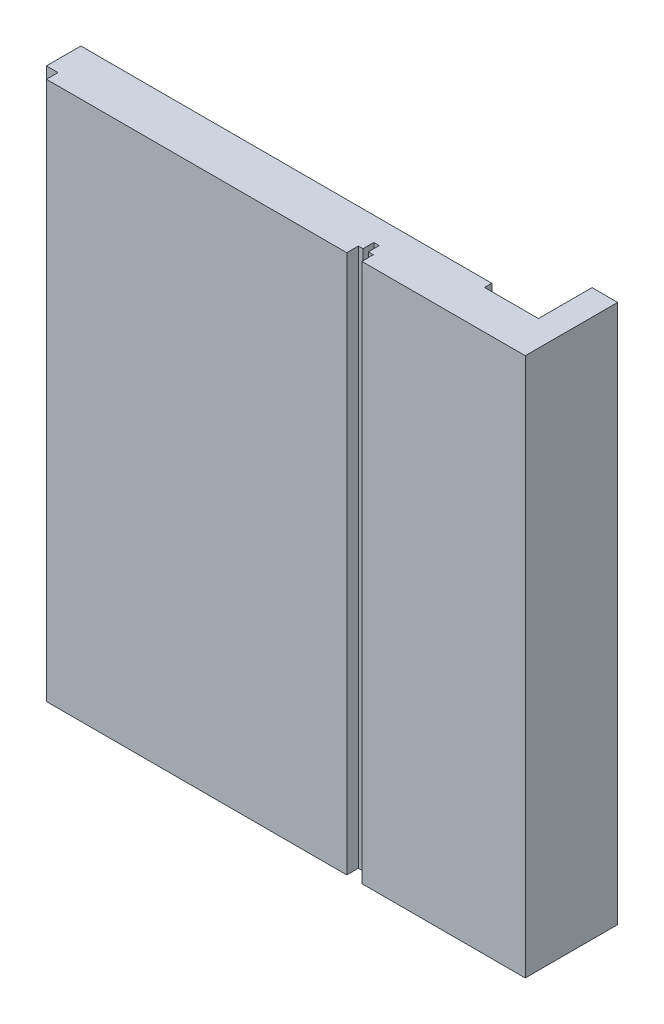
ISO-10303-21;
HEADER;
FILE_DESCRIPTION(('STEP AP214'),'2;1');
FILE_NAME('part.step','',(''),(''),'','','');
FILE_SCHEMA(('AUTOMOTIVE_DESIGN { 1 0 10303 214 1 1 1 1 }'));
ENDSEC;
DATA;
#1=APPLICATION_CONTEXT('core data for automotive mechanical design processes');
#2=APPLICATION_PROTOCOL_DEFINITION('international standard','automotive_design',2000,#1);
#3=PRODUCT_CONTEXT('',#1,'mechanical');
#4=PRODUCT('Part','Part','',(#3));
#5=PRODUCT_RELATED_PRODUCT_CATEGORY('part','',(#4));
#6=PRODUCT_DEFINITION_FORMATION('','',#4);
#7=PRODUCT_DEFINITION_CONTEXT('part definition',#1,'design');
#8=PRODUCT_DEFINITION('design','',#6,#7);
#9=PRODUCT_DEFINITION_SHAPE('','',#8);
#10=(LENGTH_UNIT() NAMED_UNIT(*) SI_UNIT(.MILLI.,.METRE.));
#11=(NAMED_UNIT(*) PLANE_ANGLE_UNIT() SI_UNIT($,.RADIAN.));
#12=(NAMED_UNIT(*) SI_UNIT($,.STERADIAN.) SOLID_ANGLE_UNIT());
#13=UNCERTAINTY_MEASURE_WITH_UNIT(LENGTH_MEASURE(1.E-05),#10,'distance_accuracy_value','');
#14=(GEOMETRIC_REPRESENTATION_CONTEXT(3) GLOBAL_UNCERTAINTY_ASSIGNED_CONTEXT((#13)) GLOBAL_UNIT_ASSIGNED_CONTEXT((#10,
#11,#12)) REPRESENTATION_CONTEXT('',''));
#15=CARTESIAN_POINT('',(0.,0.,0.));
#16=DIRECTION('',(0.,0.,1.));
#17=DIRECTION('',(1.,0.,0.));
#18=AXIS2_PLACEMENT_3D('',#15,#16,#17);
#19=CARTESIAN_POINT('',(0.,100.,0.));
#20=DIRECTION('',(-1.,0.,0.));
#21=DIRECTION('',(0.,0.,1.));
#22=AXIS2_PLACEMENT_3D('',#19,#20,#21);
#23=PLANE('',#22);
#24=DIRECTION('',(0.,0.,-1.));
#25=VECTOR('',#24,1.);
#26=CARTESIAN_POINT('',(0.,0.,0.));
#27=LINE('',#26,#25);
#28=CARTESIAN_POINT('',(0.,0.,2.14));
#29=VERTEX_POINT('',#28);
#30=CARTESIAN_POINT('',(0.,0.,-15.));
#31=VERTEX_POINT('',#30);
#32=EDGE_CURVE('E115',#29,#31,#27,.T.);
#33=ORIENTED_EDGE('',*,*,#32,.T.);
#34=DIRECTION('',(0.,-1.,0.));
#35=VECTOR('',#34,1.);
#36=CARTESIAN_POINT('',(0.,100.,-15.));
#37=LINE('',#36,#35);
#38=CARTESIAN_POINT('',(0.,100.,-15.));
#39=VERTEX_POINT('',#38);
#40=EDGE_CURVE('E11',#39,#31,#37,.T.);
#41=ORIENTED_EDGE('',*,*,#40,.F.);
#42=DIRECTION('',(0.,0.,-1.));
#43=VECTOR('',#42,1.);
#44=CARTESIAN_POINT('',(0.,100.,2.14));
#45=LINE('',#44,#43);
#46=CARTESIAN_POINT('',(0.,100.,2.14));
#47=VERTEX_POINT('',#46);
#48=EDGE_CURVE('E121',#47,#39,#45,.T.);
#49=ORIENTED_EDGE('',*,*,#48,.F.);
#50=DIRECTION('',(0.,-1.,0.));
#51=VECTOR('',#50,1.);
#52=CARTESIAN_POINT('',(0.,100.,2.14));
#53=LINE('',#52,#51);
#54=EDGE_CURVE('E185',#47,#29,#53,.T.);
#55=ORIENTED_EDGE('',*,*,#54,.T.);
#56=EDGE_LOOP('',(#33,#41,#49,#55));
#57=FACE_BOUND('',#56,.T.);
#58=ADVANCED_FACE('F33',(#57),#23,.F.);
#59=CARTESIAN_POINT('',(0.,100.,-15.));
#60=DIRECTION('',(0.,0.,1.));
#61=DIRECTION('',(1.,0.,0.));
#62=AXIS2_PLACEMENT_3D('',#59,#60,#61);
#63=PLANE('',#62);
#64=DIRECTION('',(-1.,0.,0.));
#65=VECTOR('',#64,1.);
#66=CARTESIAN_POINT('',(0.,0.,-15.));
#67=LINE('',#66,#65);
#68=CARTESIAN_POINT('',(-4.75,0.,-15.));
#69=VERTEX_POINT('',#68);
#70=EDGE_CURVE('E190',#31,#69,#67,.T.);
#71=ORIENTED_EDGE('',*,*,#70,.T.);
#72=DIRECTION('',(0.,-1.,0.));
#73=VECTOR('',#72,1.);
#74=CARTESIAN_POINT('',(-4.75,100.,-15.));
#75=LINE('',#74,#73);
#76=CARTESIAN_POINT('',(-4.75,100.,-15.));
#77=VERTEX_POINT('',#76);
#78=EDGE_CURVE('E41',#77,#69,#75,.T.);
#79=ORIENTED_EDGE('',*,*,#78,.F.);
#80=DIRECTION('',(-1.,0.,0.));
#81=VECTOR('',#80,1.);
#82=CARTESIAN_POINT('',(0.,100.,-15.));
#83=LINE('',#82,#81);
#84=EDGE_CURVE('E320',#39,#77,#83,.T.);
#85=ORIENTED_EDGE('',*,*,#84,.F.);
#86=ORIENTED_EDGE('',*,*,#40,.T.);
#87=EDGE_LOOP('',(#71,#79,#85,#86));
#88=FACE_BOUND('',#87,.T.);
#89=ADVANCED_FACE('F323',(#88),#63,.F.);
#90=CARTESIAN_POINT('',(-4.75,100.,-15.));
#91=DIRECTION('',(1.,0.,0.));
#92=DIRECTION('',(0.,0.,-1.));
#93=AXIS2_PLACEMENT_3D('',#90,#91,#92);
#94=PLANE('',#93);
#95=DIRECTION('',(0.,0.,1.));
#96=VECTOR('',#95,1.);
#97=CARTESIAN_POINT('',(-4.75,0.,-15.));
#98=LINE('',#97,#96);
#99=CARTESIAN_POINT('',(-4.75,0.,-5.05));
#100=VERTEX_POINT('',#99);
#101=EDGE_CURVE('E192',#69,#100,#98,.T.);
#102=ORIENTED_EDGE('',*,*,#101,.T.);
#103=DIRECTION('',(0.,-1.,0.));
#104=VECTOR('',#103,1.);
#105=CARTESIAN_POINT('',(-4.75,100.,-5.05));
#106=LINE('',#105,#104);
#107=CARTESIAN_POINT('',(-4.75,100.,-5.05));
#108=VERTEX_POINT('',#107);
#109=EDGE_CURVE('E259',#108,#100,#106,.T.);
#110=ORIENTED_EDGE('',*,*,#109,.F.);
#111=DIRECTION('',(0.,0.,1.));
#112=VECTOR('',#111,1.);
#113=CARTESIAN_POINT('',(-4.75,100.,-15.));
#114=LINE('',#113,#112);
#115=EDGE_CURVE('E268',#77,#108,#114,.T.);
#116=ORIENTED_EDGE('',*,*,#115,.F.);
#117=ORIENTED_EDGE('',*,*,#78,.T.);
#118=EDGE_LOOP('',(#102,#110,#116,#117));
#119=FACE_BOUND('',#118,.T.);
#120=ADVANCED_FACE('F266',(#119),#94,.F.);
#121=CARTESIAN_POINT('',(-4.75,100.,-5.05));
#122=DIRECTION('',(0.,0.,1.));
#123=DIRECTION('',(1.,0.,0.));
#124=AXIS2_PLACEMENT_3D('',#121,#122,#123);
#125=PLANE('',#124);
#126=DIRECTION('',(-1.,0.,0.));
#127=VECTOR('',#126,1.);
#128=CARTESIAN_POINT('',(-4.75,0.,-5.05));
#129=LINE('',#128,#127);
#130=CARTESIAN_POINT('',(-14.75,0.,-5.05));
#131=VERTEX_POINT('',#130);
#132=EDGE_CURVE('E194',#100,#131,#129,.T.);
#133=ORIENTED_EDGE('',*,*,#132,.T.);
#134=DIRECTION('',(0.,-1.,0.));
#135=VECTOR('',#134,1.);
#136=CARTESIAN_POINT('',(-14.75,100.,-5.05));
#137=LINE('',#136,#135);
#138=CARTESIAN_POINT('',(-14.75,100.,-5.05));
#139=VERTEX_POINT('',#138);
#140=EDGE_CURVE('E256',#139,#131,#137,.T.);
#141=ORIENTED_EDGE('',*,*,#140,.F.);
#142=DIRECTION('',(-1.,0.,0.));
#143=VECTOR('',#142,1.);
#144=CARTESIAN_POINT('',(-4.75,100.,-5.05));
#145=LINE('',#144,#143);
#146=EDGE_CURVE('E286',#108,#139,#145,.T.);
#147=ORIENTED_EDGE('',*,*,#146,.F.);
#148=ORIENTED_EDGE('',*,*,#109,.T.);
#149=EDGE_LOOP('',(#133,#141,#147,#148));
#150=FACE_BOUND('',#149,.T.);
#151=ADVANCED_FACE('F277',(#150),#125,.F.);
#152=CARTESIAN_POINT('',(-14.75,100.,-5.05));
#153=DIRECTION('',(-1.,0.,0.));
#154=DIRECTION('',(0.,0.,1.));
#155=AXIS2_PLACEMENT_3D('',#152,#153,#154);
#156=PLANE('',#155);
#157=DIRECTION('',(0.,0.,-1.));
#158=VECTOR('',#157,1.);
#159=CARTESIAN_POINT('',(-14.75,0.,-5.05));
#160=LINE('',#159,#158);
#161=CARTESIAN_POINT('',(-14.75,0.,-6.4));
#162=VERTEX_POINT('',#161);
#163=EDGE_CURVE('E196',#131,#162,#160,.T.);
#164=ORIENTED_EDGE('',*,*,#163,.T.);
#165=DIRECTION('',(0.,-1.,0.));
#166=VECTOR('',#165,1.);
#167=CARTESIAN_POINT('',(-14.75,100.,-6.4));
#168=LINE('',#167,#166);
#169=CARTESIAN_POINT('',(-14.75,100.,-6.4));
#170=VERTEX_POINT('',#169);
#171=EDGE_CURVE('E253',#170,#162,#168,.T.);
#172=ORIENTED_EDGE('',*,*,#171,.F.);
#173=DIRECTION('',(0.,0.,-1.));
#174=VECTOR('',#173,1.);
#175=CARTESIAN_POINT('',(-14.75,100.,-5.05));
#176=LINE('',#175,#174);
#177=EDGE_CURVE('E283',#139,#170,#176,.T.);
#178=ORIENTED_EDGE('',*,*,#177,.F.);
#179=ORIENTED_EDGE('',*,*,#140,.T.);
#180=EDGE_LOOP('',(#164,#172,#178,#179));
#181=FACE_BOUND('',#180,.T.);
#182=ADVANCED_FACE('F281',(#181),#156,.F.);
#183=CARTESIAN_POINT('',(-14.75,100.,-6.4));
#184=DIRECTION('',(0.,0.,1.));
#185=DIRECTION('',(1.,0.,0.));
#186=AXIS2_PLACEMENT_3D('',#183,#184,#185);
#187=PLANE('',#186);
#188=DIRECTION('',(-1.,0.,0.));
#189=VECTOR('',#188,1.);
#190=CARTESIAN_POINT('',(-14.75,0.,-6.4));
#191=LINE('',#190,#189);
#192=CARTESIAN_POINT('',(-91.,0.,-6.39999999999999));
#193=VERTEX_POINT('',#192);
#194=EDGE_CURVE('E198',#162,#193,#191,.T.);
#195=ORIENTED_EDGE('',*,*,#194,.T.);
#196=DIRECTION('',(0.,-1.,0.));
#197=VECTOR('',#196,1.);
#198=CARTESIAN_POINT('',(-91.,100.,-6.39999999999999));
#199=LINE('',#198,#197);
#200=CARTESIAN_POINT('',(-91.,100.,-6.39999999999999));
#201=VERTEX_POINT('',#200);
#202=EDGE_CURVE('E250',#201,#193,#199,.T.);
#203=ORIENTED_EDGE('',*,*,#202,.F.);
#204=DIRECTION('',(-1.,0.,0.));
#205=VECTOR('',#204,1.);
#206=CARTESIAN_POINT('',(-14.75,100.,-6.4));
#207=LINE('',#206,#205);
#208=EDGE_CURVE('E285',#170,#201,#207,.T.);
#209=ORIENTED_EDGE('',*,*,#208,.F.);
#210=ORIENTED_EDGE('',*,*,#171,.T.);
#211=EDGE_LOOP('',(#195,#203,#209,#210));
#212=FACE_BOUND('',#211,.T.);
#213=ADVANCED_FACE('F335',(#212),#187,.F.);
#214=CARTESIAN_POINT('',(-91.,100.,0.));
#215=DIRECTION('',(1.,0.,0.));
#216=DIRECTION('',(0.,0.,-1.));
#217=AXIS2_PLACEMENT_3D('',#214,#215,#216);
#218=PLANE('',#217);
#219=DIRECTION('',(0.,0.,1.));
#220=VECTOR('',#219,1.);
#221=CARTESIAN_POINT('',(-91.,0.,0.));
#222=LINE('',#221,#220);
#223=CARTESIAN_POINT('',(-91.,0.,0.));
#224=VERTEX_POINT('',#223);
#225=EDGE_CURVE('E200',#193,#224,#222,.T.);
#226=ORIENTED_EDGE('',*,*,#225,.T.);
#227=DIRECTION('',(0.,-1.,0.));
#228=VECTOR('',#227,1.);
#229=CARTESIAN_POINT('',(-91.,100.,0.));
#230=LINE('',#229,#228);
#231=CARTESIAN_POINT('',(-91.,100.,0.));
#232=VERTEX_POINT('',#231);
#233=EDGE_CURVE('E247',#232,#224,#230,.T.);
#234=ORIENTED_EDGE('',*,*,#233,.F.);
#235=DIRECTION('',(0.,0.,1.));
#236=VECTOR('',#235,1.);
#237=CARTESIAN_POINT('',(-91.,100.,0.));
#238=LINE('',#237,#236);
#239=EDGE_CURVE('E288',#201,#232,#238,.T.);
#240=ORIENTED_EDGE('',*,*,#239,.F.);
#241=ORIENTED_EDGE('',*,*,#202,.T.);
#242=EDGE_LOOP('',(#226,#234,#240,#241));
#243=FACE_BOUND('',#242,.T.);
#244=ADVANCED_FACE('F338',(#243),#218,.F.);
#245=CARTESIAN_POINT('',(-91.,100.,0.));
#246=DIRECTION('',(0.,0.,-1.));
#247=DIRECTION('',(-1.,0.,0.));
#248=AXIS2_PLACEMENT_3D('',#245,#246,#247);
#249=PLANE('',#248);
#250=DIRECTION('',(1.,0.,0.));
#251=VECTOR('',#250,1.);
#252=CARTESIAN_POINT('',(-91.,0.,0.));
#253=LINE('',#252,#251);
#254=CARTESIAN_POINT('',(-88.85,0.,0.));
#255=VERTEX_POINT('',#254);
#256=EDGE_CURVE('E202',#224,#255,#253,.T.);
#257=ORIENTED_EDGE('',*,*,#256,.T.);
#258=DIRECTION('',(0.,-1.,0.));
#259=VECTOR('',#258,1.);
#260=CARTESIAN_POINT('',(-88.85,100.,0.));
#261=LINE('',#260,#259);
#262=CARTESIAN_POINT('',(-88.85,100.,0.));
#263=VERTEX_POINT('',#262);
#264=EDGE_CURVE('E244',#263,#255,#261,.T.);
#265=ORIENTED_EDGE('',*,*,#264,.F.);
#266=DIRECTION('',(1.,0.,0.));
#267=VECTOR('',#266,1.);
#268=CARTESIAN_POINT('',(-91.,100.,0.));
#269=LINE('',#268,#267);
#270=EDGE_CURVE('E294',#232,#263,#269,.T.);
#271=ORIENTED_EDGE('',*,*,#270,.F.);
#272=ORIENTED_EDGE('',*,*,#233,.T.);
#273=EDGE_LOOP('',(#257,#265,#271,#272));
#274=FACE_BOUND('',#273,.T.);
#275=ADVANCED_FACE('F342',(#274),#249,.F.);
#276=CARTESIAN_POINT('',(-88.85,100.,0.));
#277=DIRECTION('',(1.,0.,0.));
#278=DIRECTION('',(0.,0.,-1.));
#279=AXIS2_PLACEMENT_3D('',#276,#277,#278);
#280=PLANE('',#279);
#281=DIRECTION('',(0.,0.,1.));
#282=VECTOR('',#281,1.);
#283=CARTESIAN_POINT('',(-88.85,0.,0.));
#284=LINE('',#283,#282);
#285=CARTESIAN_POINT('',(-88.85,0.,2.14));
#286=VERTEX_POINT('',#285);
#287=EDGE_CURVE('E204',#255,#286,#284,.T.);
#288=ORIENTED_EDGE('',*,*,#287,.T.);
#289=DIRECTION('',(0.,-1.,0.));
#290=VECTOR('',#289,1.);
#291=CARTESIAN_POINT('',(-88.85,100.,2.14));
#292=LINE('',#291,#290);
#293=CARTESIAN_POINT('',(-88.85,100.,2.14));
#294=VERTEX_POINT('',#293);
#295=EDGE_CURVE('E241',#294,#286,#292,.T.);
#296=ORIENTED_EDGE('',*,*,#295,.F.);
#297=DIRECTION('',(0.,0.,1.));
#298=VECTOR('',#297,1.);
#299=CARTESIAN_POINT('',(-88.85,100.,0.));
#300=LINE('',#299,#298);
#301=EDGE_CURVE('E296',#263,#294,#300,.T.);
#302=ORIENTED_EDGE('',*,*,#301,.F.);
#303=ORIENTED_EDGE('',*,*,#264,.T.);
#304=EDGE_LOOP('',(#288,#296,#302,#303));
#305=FACE_BOUND('',#304,.T.);
#306=ADVANCED_FACE('F346',(#305),#280,.F.);
#307=CARTESIAN_POINT('',(-88.85,100.,2.14));
#308=DIRECTION('',(0.,0.,-1.));
#309=DIRECTION('',(-1.,0.,0.));
#310=AXIS2_PLACEMENT_3D('',#307,#308,#309);
#311=PLANE('',#310);
#312=DIRECTION('',(1.,0.,0.));
#313=VECTOR('',#312,1.);
#314=CARTESIAN_POINT('',(-88.85,0.,2.14));
#315=LINE('',#314,#313);
#316=CARTESIAN_POINT('',(-33.12,0.,2.14));
#317=VERTEX_POINT('',#316);
#318=EDGE_CURVE('E206',#286,#317,#315,.T.);
#319=ORIENTED_EDGE('',*,*,#318,.T.);
#320=DIRECTION('',(0.,-1.,0.));
#321=VECTOR('',#320,1.);
#322=CARTESIAN_POINT('',(-33.12,100.,2.14));
#323=LINE('',#322,#321);
#324=CARTESIAN_POINT('',(-33.12,100.,2.14));
#325=VERTEX_POINT('',#324);
#326=EDGE_CURVE('E238',#325,#317,#323,.T.);
#327=ORIENTED_EDGE('',*,*,#326,.F.);
#328=DIRECTION('',(1.,0.,0.));
#329=VECTOR('',#328,1.);
#330=CARTESIAN_POINT('',(-88.85,100.,2.14));
#331=LINE('',#330,#329);
#332=EDGE_CURVE('E298',#294,#325,#331,.T.);
#333=ORIENTED_EDGE('',*,*,#332,.F.);
#334=ORIENTED_EDGE('',*,*,#295,.T.);
#335=EDGE_LOOP('',(#319,#327,#333,#334));
#336=FACE_BOUND('',#335,.T.);
#337=ADVANCED_FACE('F350',(#336),#311,.F.);
#338=CARTESIAN_POINT('',(-33.12,100.,2.14));
#339=DIRECTION('',(-1.,0.,0.));
#340=DIRECTION('',(0.,0.,1.));
#341=AXIS2_PLACEMENT_3D('',#338,#339,#340);
#342=PLANE('',#341);
#343=DIRECTION('',(0.,0.,-1.));
#344=VECTOR('',#343,1.);
#345=CARTESIAN_POINT('',(-33.12,0.,2.14));
#346=LINE('',#345,#344);
#347=CARTESIAN_POINT('',(-33.12,0.,0.));
#348=VERTEX_POINT('',#347);
#349=EDGE_CURVE('E208',#317,#348,#346,.T.);
#350=ORIENTED_EDGE('',*,*,#349,.T.);
#351=DIRECTION('',(0.,-1.,0.));
#352=VECTOR('',#351,1.);
#353=CARTESIAN_POINT('',(-33.12,100.,0.));
#354=LINE('',#353,#352);
#355=CARTESIAN_POINT('',(-33.12,100.,0.));
#356=VERTEX_POINT('',#355);
#357=EDGE_CURVE('E235',#356,#348,#354,.T.);
#358=ORIENTED_EDGE('',*,*,#357,.F.);
#359=DIRECTION('',(0.,0.,-1.));
#360=VECTOR('',#359,1.);
#361=CARTESIAN_POINT('',(-33.12,100.,2.14));
#362=LINE('',#361,#360);
#363=EDGE_CURVE('E300',#325,#356,#362,.T.);
#364=ORIENTED_EDGE('',*,*,#363,.F.);
#365=ORIENTED_EDGE('',*,*,#326,.T.);
#366=EDGE_LOOP('',(#350,#358,#364,#365));
#367=FACE_BOUND('',#366,.T.);
#368=ADVANCED_FACE('F354',(#367),#342,.F.);
#369=CARTESIAN_POINT('',(-32.25,100.,0.));
#370=DIRECTION('',(0.,0.,-1.));
#371=DIRECTION('',(-1.,0.,0.));
#372=AXIS2_PLACEMENT_3D('',#369,#370,#371);
#373=PLANE('',#372);
#374=DIRECTION('',(1.,0.,0.));
#375=VECTOR('',#374,1.);
#376=CARTESIAN_POINT('',(-32.25,0.,0.));
#377=LINE('',#376,#375);
#378=CARTESIAN_POINT('',(-32.25,0.,0.));
#379=VERTEX_POINT('',#378);
#380=EDGE_CURVE('E210',#348,#379,#377,.T.);
#381=ORIENTED_EDGE('',*,*,#380,.T.);
#382=DIRECTION('',(0.,-1.,0.));
#383=VECTOR('',#382,1.);
#384=CARTESIAN_POINT('',(-32.25,100.,0.));
#385=LINE('',#384,#383);
#386=CARTESIAN_POINT('',(-32.25,100.,0.));
#387=VERTEX_POINT('',#386);
#388=EDGE_CURVE('E232',#387,#379,#385,.T.);
#389=ORIENTED_EDGE('',*,*,#388,.F.);
#390=DIRECTION('',(1.,0.,0.));
#391=VECTOR('',#390,1.);
#392=CARTESIAN_POINT('',(-32.25,100.,0.));
#393=LINE('',#392,#391);
#394=EDGE_CURVE('E302',#356,#387,#393,.T.);
#395=ORIENTED_EDGE('',*,*,#394,.F.);
#396=ORIENTED_EDGE('',*,*,#357,.T.);
#397=EDGE_LOOP('',(#381,#389,#395,#396));
#398=FACE_BOUND('',#397,.T.);
#399=ADVANCED_FACE('F358',(#398),#373,.F.);
#400=CARTESIAN_POINT('',(-32.25,100.,0.));
#401=DIRECTION('',(-1.,0.,0.));
#402=DIRECTION('',(0.,0.,1.));
#403=AXIS2_PLACEMENT_3D('',#400,#401,#402);
#404=PLANE('',#403);
#405=DIRECTION('',(0.,0.,-1.));
#406=VECTOR('',#405,1.);
#407=CARTESIAN_POINT('',(-32.25,0.,0.));
#408=LINE('',#407,#406);
#409=CARTESIAN_POINT('',(-32.25,0.,-2.00000000000001));
#410=VERTEX_POINT('',#409);
#411=EDGE_CURVE('E212',#379,#410,#408,.T.);
#412=ORIENTED_EDGE('',*,*,#411,.T.);
#413=DIRECTION('',(0.,-1.,0.));
#414=VECTOR('',#413,1.);
#415=CARTESIAN_POINT('',(-32.25,100.,-2.00000000000001));
#416=LINE('',#415,#414);
#417=CARTESIAN_POINT('',(-32.25,100.,-2.00000000000001));
#418=VERTEX_POINT('',#417);
#419=EDGE_CURVE('E229',#418,#410,#416,.T.);
#420=ORIENTED_EDGE('',*,*,#419,.F.);
#421=DIRECTION('',(0.,0.,-1.));
#422=VECTOR('',#421,1.);
#423=CARTESIAN_POINT('',(-32.25,100.,0.));
#424=LINE('',#423,#422);
#425=EDGE_CURVE('E304',#387,#418,#424,.T.);
#426=ORIENTED_EDGE('',*,*,#425,.F.);
#427=ORIENTED_EDGE('',*,*,#388,.T.);
#428=EDGE_LOOP('',(#412,#420,#426,#427));
#429=FACE_BOUND('',#428,.T.);
#430=ADVANCED_FACE('F362',(#429),#404,.F.);
#431=CARTESIAN_POINT('',(-32.25,100.,-2.00000000000001));
#432=DIRECTION('',(0.,0.,-1.));
#433=DIRECTION('',(-1.,0.,0.));
#434=AXIS2_PLACEMENT_3D('',#431,#432,#433);
#435=PLANE('',#434);
#436=DIRECTION('',(1.,0.,0.));
#437=VECTOR('',#436,1.);
#438=CARTESIAN_POINT('',(-32.25,0.,-2.00000000000001));
#439=LINE('',#438,#437);
#440=CARTESIAN_POINT('',(-31.25,0.,-2.00000000000001));
#441=VERTEX_POINT('',#440);
#442=EDGE_CURVE('E214',#410,#441,#439,.T.);
#443=ORIENTED_EDGE('',*,*,#442,.T.);
#444=DIRECTION('',(0.,-1.,0.));
#445=VECTOR('',#444,1.);
#446=CARTESIAN_POINT('',(-31.25,100.,-2.00000000000001));
#447=LINE('',#446,#445);
#448=CARTESIAN_POINT('',(-31.25,100.,-2.00000000000001));
#449=VERTEX_POINT('',#448);
#450=EDGE_CURVE('E226',#449,#441,#447,.T.);
#451=ORIENTED_EDGE('',*,*,#450,.F.);
#452=DIRECTION('',(1.,0.,0.));
#453=VECTOR('',#452,1.);
#454=CARTESIAN_POINT('',(-32.25,100.,-2.00000000000001));
#455=LINE('',#454,#453);
#456=EDGE_CURVE('E306',#418,#449,#455,.T.);
#457=ORIENTED_EDGE('',*,*,#456,.F.);
#458=ORIENTED_EDGE('',*,*,#419,.T.);
#459=EDGE_LOOP('',(#443,#451,#457,#458));
#460=FACE_BOUND('',#459,.T.);
#461=ADVANCED_FACE('F312',(#460),#435,.F.);
#462=CARTESIAN_POINT('',(-31.25,100.,-2.00000000000001));
#463=DIRECTION('',(1.,0.,0.));
#464=DIRECTION('',(0.,0.,-1.));
#465=AXIS2_PLACEMENT_3D('',#462,#463,#464);
#466=PLANE('',#465);
#467=DIRECTION('',(0.,0.,1.));
#468=VECTOR('',#467,1.);
#469=CARTESIAN_POINT('',(-31.25,0.,-2.00000000000001));
#470=LINE('',#469,#468);
#471=CARTESIAN_POINT('',(-31.25,0.,0.));
#472=VERTEX_POINT('',#471);
#473=EDGE_CURVE('E216',#441,#472,#470,.T.);
#474=ORIENTED_EDGE('',*,*,#473,.T.);
#475=DIRECTION('',(0.,-1.,0.));
#476=VECTOR('',#475,1.);
#477=CARTESIAN_POINT('',(-31.25,100.,0.));
#478=LINE('',#477,#476);
#479=CARTESIAN_POINT('',(-31.25,100.,0.));
#480=VERTEX_POINT('',#479);
#481=EDGE_CURVE('E180',#480,#472,#478,.T.);
#482=ORIENTED_EDGE('',*,*,#481,.F.);
#483=DIRECTION('',(0.,0.,1.));
#484=VECTOR('',#483,1.);
#485=CARTESIAN_POINT('',(-31.25,100.,-2.00000000000001));
#486=LINE('',#485,#484);
#487=EDGE_CURVE('E171',#449,#480,#486,.T.);
#488=ORIENTED_EDGE('',*,*,#487,.F.);
#489=ORIENTED_EDGE('',*,*,#450,.T.);
#490=EDGE_LOOP('',(#474,#482,#488,#489));
#491=FACE_BOUND('',#490,.T.);
#492=ADVANCED_FACE('F316',(#491),#466,.F.);
#493=CARTESIAN_POINT('',(-30.32,100.,0.));
#494=DIRECTION('',(0.,0.,-1.));
#495=DIRECTION('',(-1.,0.,0.));
#496=AXIS2_PLACEMENT_3D('',#493,#494,#495);
#497=PLANE('',#496);
#498=DIRECTION('',(1.,0.,0.));
#499=VECTOR('',#498,1.);
#500=CARTESIAN_POINT('',(-30.32,0.,0.));
#501=LINE('',#500,#499);
#502=CARTESIAN_POINT('',(-30.32,0.,0.));
#503=VERTEX_POINT('',#502);
#504=EDGE_CURVE('E179',#472,#503,#501,.T.);
#505=ORIENTED_EDGE('',*,*,#504,.T.);
#506=DIRECTION('',(0.,-1.,0.));
#507=VECTOR('',#506,1.);
#508=CARTESIAN_POINT('',(-30.32,100.,0.));
#509=LINE('',#508,#507);
#510=CARTESIAN_POINT('',(-30.32,100.,0.));
#511=VERTEX_POINT('',#510);
#512=EDGE_CURVE('E176',#511,#503,#509,.T.);
#513=ORIENTED_EDGE('',*,*,#512,.F.);
#514=DIRECTION('',(1.,0.,0.));
#515=VECTOR('',#514,1.);
#516=CARTESIAN_POINT('',(-30.32,100.,0.));
#517=LINE('',#516,#515);
#518=EDGE_CURVE('E165',#480,#511,#517,.T.);
#519=ORIENTED_EDGE('',*,*,#518,.F.);
#520=ORIENTED_EDGE('',*,*,#481,.T.);
#521=EDGE_LOOP('',(#505,#513,#519,#520));
#522=FACE_BOUND('',#521,.T.);
#523=ADVANCED_FACE('F177',(#522),#497,.F.);
#524=CARTESIAN_POINT('',(-30.32,100.,0.));
#525=DIRECTION('',(1.,0.,0.));
#526=DIRECTION('',(0.,0.,-1.));
#527=AXIS2_PLACEMENT_3D('',#524,#525,#526);
#528=PLANE('',#527);
#529=DIRECTION('',(0.,0.,1.));
#530=VECTOR('',#529,1.);
#531=CARTESIAN_POINT('',(-30.32,0.,0.));
#532=LINE('',#531,#530);
#533=CARTESIAN_POINT('',(-30.32,0.,2.14));
#534=VERTEX_POINT('',#533);
#535=EDGE_CURVE('E108',#503,#534,#532,.T.);
#536=ORIENTED_EDGE('',*,*,#535,.T.);
#537=DIRECTION('',(0.,-1.,0.));
#538=VECTOR('',#537,1.);
#539=CARTESIAN_POINT('',(-30.32,100.,2.14));
#540=LINE('',#539,#538);
#541=CARTESIAN_POINT('',(-30.32,100.,2.14));
#542=VERTEX_POINT('',#541);
#543=EDGE_CURVE('E181',#542,#534,#540,.T.);
#544=ORIENTED_EDGE('',*,*,#543,.F.);
#545=DIRECTION('',(0.,0.,1.));
#546=VECTOR('',#545,1.);
#547=CARTESIAN_POINT('',(-30.32,100.,0.));
#548=LINE('',#547,#546);
#549=EDGE_CURVE('E169',#511,#542,#548,.T.);
#550=ORIENTED_EDGE('',*,*,#549,.F.);
#551=ORIENTED_EDGE('',*,*,#512,.T.);
#552=EDGE_LOOP('',(#536,#544,#550,#551));
#553=FACE_BOUND('',#552,.T.);
#554=ADVANCED_FACE('F183',(#553),#528,.F.);
#555=CARTESIAN_POINT('',(-30.32,100.,2.14));
#556=DIRECTION('',(0.,0.,-1.));
#557=DIRECTION('',(-1.,0.,0.));
#558=AXIS2_PLACEMENT_3D('',#555,#556,#557);
#559=PLANE('',#558);
#560=DIRECTION('',(1.,0.,0.));
#561=VECTOR('',#560,1.);
#562=CARTESIAN_POINT('',(-30.32,0.,2.14));
#563=LINE('',#562,#561);
#564=EDGE_CURVE('E220',#534,#29,#563,.T.);
#565=ORIENTED_EDGE('',*,*,#564,.T.);
#566=ORIENTED_EDGE('',*,*,#54,.F.);
#567=DIRECTION('',(1.,0.,0.));
#568=VECTOR('',#567,1.);
#569=CARTESIAN_POINT('',(-30.32,100.,2.14));
#570=LINE('',#569,#568);
#571=EDGE_CURVE('E49',#542,#47,#570,.T.);
#572=ORIENTED_EDGE('',*,*,#571,.F.);
#573=ORIENTED_EDGE('',*,*,#543,.T.);
#574=EDGE_LOOP('',(#565,#566,#572,#573));
#575=FACE_BOUND('',#574,.T.);
#576=ADVANCED_FACE('F318',(#575),#559,.F.);
#577=CARTESIAN_POINT('',(0.,100.,0.));
#578=DIRECTION('',(0.,1.,0.));
#579=DIRECTION('',(0.,0.,1.));
#580=AXIS2_PLACEMENT_3D('',#577,#578,#579);
#581=PLANE('',#580);
#582=ORIENTED_EDGE('',*,*,#48,.T.);
#583=ORIENTED_EDGE('',*,*,#84,.T.);
#584=ORIENTED_EDGE('',*,*,#115,.T.);
#585=ORIENTED_EDGE('',*,*,#146,.T.);
#586=ORIENTED_EDGE('',*,*,#177,.T.);
#587=ORIENTED_EDGE('',*,*,#208,.T.);
#588=ORIENTED_EDGE('',*,*,#239,.T.);
#589=ORIENTED_EDGE('',*,*,#270,.T.);
#590=ORIENTED_EDGE('',*,*,#301,.T.);
#591=ORIENTED_EDGE('',*,*,#332,.T.);
#592=ORIENTED_EDGE('',*,*,#363,.T.);
#593=ORIENTED_EDGE('',*,*,#394,.T.);
#594=ORIENTED_EDGE('',*,*,#425,.T.);
#595=ORIENTED_EDGE('',*,*,#456,.T.);
#596=ORIENTED_EDGE('',*,*,#487,.T.);
#597=ORIENTED_EDGE('',*,*,#518,.T.);
#598=ORIENTED_EDGE('',*,*,#549,.T.);
#599=ORIENTED_EDGE('',*,*,#571,.T.);
#600=EDGE_LOOP('',(#582,#583,#584,#585,#586,#587,#588,#589,#590,#591,#592,#593,#594,#595,#596,
#597,#598,#599));
#601=FACE_BOUND('',#600,.T.);
#602=ADVANCED_FACE('F167',(#601),#581,.T.);
#603=CARTESIAN_POINT('',(0.,0.,0.));
#604=DIRECTION('',(0.,1.,0.));
#605=DIRECTION('',(0.,0.,1.));
#606=AXIS2_PLACEMENT_3D('',#603,#604,#605);
#607=PLANE('',#606);
#608=ORIENTED_EDGE('',*,*,#32,.F.);
#609=ORIENTED_EDGE('',*,*,#564,.F.);
#610=ORIENTED_EDGE('',*,*,#535,.F.);
#611=ORIENTED_EDGE('',*,*,#504,.F.);
#612=ORIENTED_EDGE('',*,*,#473,.F.);
#613=ORIENTED_EDGE('',*,*,#442,.F.);
#614=ORIENTED_EDGE('',*,*,#411,.F.);
#615=ORIENTED_EDGE('',*,*,#380,.F.);
#616=ORIENTED_EDGE('',*,*,#349,.F.);
#617=ORIENTED_EDGE('',*,*,#318,.F.);
#618=ORIENTED_EDGE('',*,*,#287,.F.);
#619=ORIENTED_EDGE('',*,*,#256,.F.);
#620=ORIENTED_EDGE('',*,*,#225,.F.);
#621=ORIENTED_EDGE('',*,*,#194,.F.);
#622=ORIENTED_EDGE('',*,*,#163,.F.);
#623=ORIENTED_EDGE('',*,*,#132,.F.);
#624=ORIENTED_EDGE('',*,*,#101,.F.);
#625=ORIENTED_EDGE('',*,*,#70,.F.);
#626=EDGE_LOOP('',(#608,#609,#610,#611,#612,#613,#614,#615,#616,#617,#618,#619,#620,#621,#622,
#623,#624,#625));
#627=FACE_BOUND('',#626,.T.);
#628=ADVANCED_FACE('F272',(#627),#607,.F.);
#629=CLOSED_SHELL('',(#58,#89,#120,#151,#182,#213,#244,#275,#306,#337,#368,#399,#430,#461,#492,
#523,#554,#576,#602,#628));
#630=MANIFOLD_SOLID_BREP('B2',#629);
#631=ADVANCED_BREP_SHAPE_REPRESENTATION('',(#18,#630),#14);
#632=SHAPE_DEFINITION_REPRESENTATION(#9,#631);
ENDSEC;
END-ISO-10303-21;
